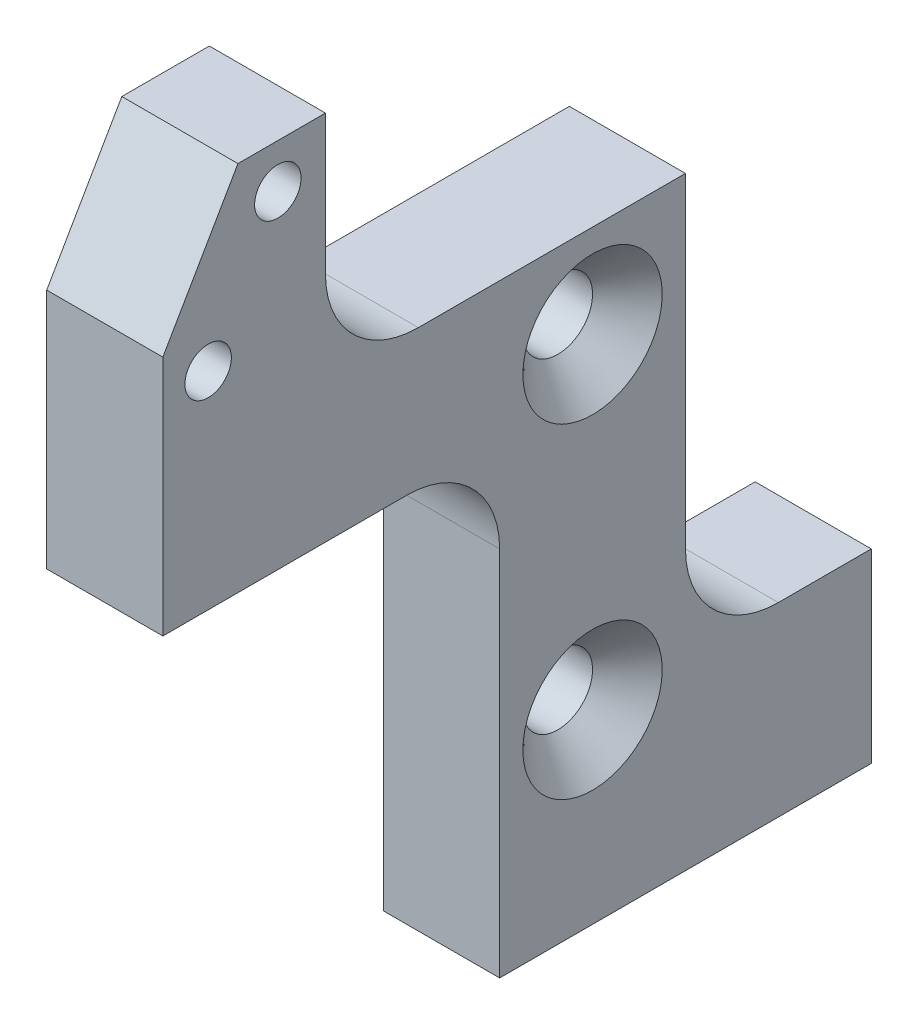
ISO-10303-21;
HEADER;
FILE_DESCRIPTION(('STEP AP214'),'2;1');
FILE_NAME('part.step','',(''),(''),'','','');
FILE_SCHEMA(('AUTOMOTIVE_DESIGN { 1 0 10303 214 1 1 1 1 }'));
ENDSEC;
DATA;
#1=APPLICATION_CONTEXT('core data for automotive mechanical design processes');
#2=APPLICATION_PROTOCOL_DEFINITION('international standard','automotive_design',2000,#1);
#3=PRODUCT_CONTEXT('',#1,'mechanical');
#4=PRODUCT('Part','Part','',(#3));
#5=PRODUCT_RELATED_PRODUCT_CATEGORY('part','',(#4));
#6=PRODUCT_DEFINITION_FORMATION('','',#4);
#7=PRODUCT_DEFINITION_CONTEXT('part definition',#1,'design');
#8=PRODUCT_DEFINITION('design','',#6,#7);
#9=PRODUCT_DEFINITION_SHAPE('','',#8);
#10=(LENGTH_UNIT() NAMED_UNIT(*) SI_UNIT(.MILLI.,.METRE.));
#11=(NAMED_UNIT(*) PLANE_ANGLE_UNIT() SI_UNIT($,.RADIAN.));
#12=(NAMED_UNIT(*) SI_UNIT($,.STERADIAN.) SOLID_ANGLE_UNIT());
#13=UNCERTAINTY_MEASURE_WITH_UNIT(LENGTH_MEASURE(1.E-05),#10,'distance_accuracy_value','');
#14=(GEOMETRIC_REPRESENTATION_CONTEXT(3) GLOBAL_UNCERTAINTY_ASSIGNED_CONTEXT((#13)) GLOBAL_UNIT_ASSIGNED_CONTEXT((#10,
#11,#12)) REPRESENTATION_CONTEXT('',''));
#15=CARTESIAN_POINT('',(0.,0.,0.));
#16=DIRECTION('',(0.,0.,1.));
#17=DIRECTION('',(1.,0.,0.));
#18=AXIS2_PLACEMENT_3D('',#15,#16,#17);
#19=CARTESIAN_POINT('',(5.,0.,0.));
#20=DIRECTION('',(-1.,0.,0.));
#21=DIRECTION('',(0.,0.,1.));
#22=AXIS2_PLACEMENT_3D('',#19,#20,#21);
#23=PLANE('',#22);
#24=CARTESIAN_POINT('',(5.,8.,-18.5));
#25=DIRECTION('',(-1.,0.,0.));
#26=DIRECTION('',(0.,0.,1.));
#27=AXIS2_PLACEMENT_3D('',#24,#25,#26);
#28=CIRCLE('',#27,3.);
#29=CARTESIAN_POINT('',(5.,8.,-15.5));
#30=VERTEX_POINT('',#29);
#31=EDGE_CURVE('E40',#30,#30,#28,.T.);
#32=ORIENTED_EDGE('',*,*,#31,.T.);
#33=EDGE_LOOP('',(#32));
#34=FACE_BOUND('',#33,.T.);
#35=CARTESIAN_POINT('',(5.,22.,-18.5));
#36=DIRECTION('',(-1.,0.,0.));
#37=DIRECTION('',(0.,0.,1.));
#38=AXIS2_PLACEMENT_3D('',#35,#36,#37);
#39=CIRCLE('',#38,3.);
#40=CARTESIAN_POINT('',(5.,22.,-15.5));
#41=VERTEX_POINT('',#40);
#42=EDGE_CURVE('E195',#41,#41,#39,.T.);
#43=ORIENTED_EDGE('',*,*,#42,.T.);
#44=EDGE_LOOP('',(#43));
#45=FACE_BOUND('',#44,.T.);
#46=CARTESIAN_POINT('',(5.,28.91,-1.95));
#47=DIRECTION('',(1.,0.,0.));
#48=DIRECTION('',(0.,0.,-1.));
#49=AXIS2_PLACEMENT_3D('',#46,#47,#48);
#50=CIRCLE('',#49,1.);
#51=CARTESIAN_POINT('',(5.,28.91,-2.95));
#52=VERTEX_POINT('',#51);
#53=EDGE_CURVE('E223',#52,#52,#50,.T.);
#54=ORIENTED_EDGE('',*,*,#53,.F.);
#55=EDGE_LOOP('',(#54));
#56=FACE_BOUND('',#55,.T.);
#57=DIRECTION('',(0.,1.,0.));
#58=VECTOR('',#57,1.);
#59=CARTESIAN_POINT('',(5.,8.,-30.5));
#60=LINE('',#59,#58);
#61=CARTESIAN_POINT('',(5.,0.,-30.5));
#62=VERTEX_POINT('',#61);
#63=CARTESIAN_POINT('',(5.,8.,-30.5));
#64=VERTEX_POINT('',#63);
#65=EDGE_CURVE('E147',#62,#64,#60,.T.);
#66=ORIENTED_EDGE('',*,*,#65,.T.);
#67=DIRECTION('',(0.,0.,1.));
#68=VECTOR('',#67,1.);
#69=CARTESIAN_POINT('',(5.,8.,-22.5));
#70=LINE('',#69,#68);
#71=CARTESIAN_POINT('',(5.,8.,-26.5));
#72=VERTEX_POINT('',#71);
#73=EDGE_CURVE('E135',#64,#72,#70,.T.);
#74=ORIENTED_EDGE('',*,*,#73,.T.);
#75=CARTESIAN_POINT('',(5.,12.,-26.5));
#76=DIRECTION('',(-1.,0.,0.));
#77=DIRECTION('',(0.,0.,1.));
#78=AXIS2_PLACEMENT_3D('',#75,#76,#77);
#79=CIRCLE('',#78,4.);
#80=CARTESIAN_POINT('',(5.,12.,-22.5));
#81=VERTEX_POINT('',#80);
#82=EDGE_CURVE('E183',#72,#81,#79,.T.);
#83=ORIENTED_EDGE('',*,*,#82,.T.);
#84=DIRECTION('',(0.,1.,0.));
#85=VECTOR('',#84,1.);
#86=CARTESIAN_POINT('',(5.,26.,-22.5));
#87=LINE('',#86,#85);
#88=CARTESIAN_POINT('',(5.,26.,-22.5));
#89=VERTEX_POINT('',#88);
#90=EDGE_CURVE('E146',#81,#89,#87,.T.);
#91=ORIENTED_EDGE('',*,*,#90,.T.);
#92=DIRECTION('',(0.,0.,1.));
#93=VECTOR('',#92,1.);
#94=CARTESIAN_POINT('',(5.,26.,-7.));
#95=LINE('',#94,#93);
#96=CARTESIAN_POINT('',(5.,26.,-11.));
#97=VERTEX_POINT('',#96);
#98=EDGE_CURVE('E228',#89,#97,#95,.T.);
#99=ORIENTED_EDGE('',*,*,#98,.T.);
#100=CARTESIAN_POINT('',(5.,30.,-11.));
#101=DIRECTION('',(-1.,0.,0.));
#102=DIRECTION('',(0.,0.,1.));
#103=AXIS2_PLACEMENT_3D('',#100,#101,#102);
#104=CIRCLE('',#103,4.);
#105=CARTESIAN_POINT('',(5.,30.,-7.));
#106=VERTEX_POINT('',#105);
#107=EDGE_CURVE('E190',#97,#106,#104,.T.);
#108=ORIENTED_EDGE('',*,*,#107,.T.);
#109=DIRECTION('',(0.,1.,0.));
#110=VECTOR('',#109,1.);
#111=CARTESIAN_POINT('',(5.,36.,-7.));
#112=LINE('',#111,#110);
#113=CARTESIAN_POINT('',(5.,36.,-7.));
#114=VERTEX_POINT('',#113);
#115=EDGE_CURVE('E230',#106,#114,#112,.T.);
#116=ORIENTED_EDGE('',*,*,#115,.T.);
#117=DIRECTION('',(0.,0.,1.));
#118=VECTOR('',#117,1.);
#119=CARTESIAN_POINT('',(5.,36.,-3.23316150746188));
#120=LINE('',#119,#118);
#121=CARTESIAN_POINT('',(5.,36.,-3.23316150746188));
#122=VERTEX_POINT('',#121);
#123=EDGE_CURVE('E232',#114,#122,#120,.T.);
#124=ORIENTED_EDGE('',*,*,#123,.T.);
#125=DIRECTION('',(0.,-0.86602540378444,0.499999999999998));
#126=VECTOR('',#125,1.);
#127=CARTESIAN_POINT('',(5.,30.4,0.));
#128=LINE('',#127,#126);
#129=CARTESIAN_POINT('',(5.,30.4,0.));
#130=VERTEX_POINT('',#129);
#131=EDGE_CURVE('E234',#122,#130,#128,.T.);
#132=ORIENTED_EDGE('',*,*,#131,.T.);
#133=DIRECTION('',(0.,-1.,0.));
#134=VECTOR('',#133,1.);
#135=CARTESIAN_POINT('',(5.,20.,0.));
#136=LINE('',#135,#134);
#137=CARTESIAN_POINT('',(5.,20.,0.));
#138=VERTEX_POINT('',#137);
#139=EDGE_CURVE('E236',#130,#138,#136,.T.);
#140=ORIENTED_EDGE('',*,*,#139,.T.);
#141=DIRECTION('',(0.,0.,-1.));
#142=VECTOR('',#141,1.);
#143=CARTESIAN_POINT('',(5.,20.,-14.5));
#144=LINE('',#143,#142);
#145=CARTESIAN_POINT('',(5.,20.,-10.5));
#146=VERTEX_POINT('',#145);
#147=EDGE_CURVE('E238',#138,#146,#144,.T.);
#148=ORIENTED_EDGE('',*,*,#147,.T.);
#149=CARTESIAN_POINT('',(5.,16.,-10.5));
#150=DIRECTION('',(-1.,0.,0.));
#151=DIRECTION('',(0.,0.,1.));
#152=AXIS2_PLACEMENT_3D('',#149,#150,#151);
#153=CIRCLE('',#152,4.);
#154=CARTESIAN_POINT('',(5.,16.,-14.5));
#155=VERTEX_POINT('',#154);
#156=EDGE_CURVE('E187',#146,#155,#153,.T.);
#157=ORIENTED_EDGE('',*,*,#156,.T.);
#158=DIRECTION('',(0.,-1.,0.));
#159=VECTOR('',#158,1.);
#160=CARTESIAN_POINT('',(5.,0.,-14.5));
#161=LINE('',#160,#159);
#162=CARTESIAN_POINT('',(5.,0.,-14.5));
#163=VERTEX_POINT('',#162);
#164=EDGE_CURVE('E241',#155,#163,#161,.T.);
#165=ORIENTED_EDGE('',*,*,#164,.T.);
#166=DIRECTION('',(0.,0.,-1.));
#167=VECTOR('',#166,1.);
#168=CARTESIAN_POINT('',(5.,0.,-30.5));
#169=LINE('',#168,#167);
#170=EDGE_CURVE('E152',#163,#62,#169,.T.);
#171=ORIENTED_EDGE('',*,*,#170,.T.);
#172=EDGE_LOOP('',(#66,#74,#83,#91,#99,#108,#116,#124,#132,#140,#148,#157,#165,#171));
#173=FACE_BOUND('',#172,.T.);
#174=CARTESIAN_POINT('',(5.,34.1061524227066,-4.94999999999999));
#175=DIRECTION('',(1.,0.,0.));
#176=DIRECTION('',(0.,0.,-1.));
#177=AXIS2_PLACEMENT_3D('',#174,#175,#176);
#178=CIRCLE('',#177,0.999999999999998);
#179=CARTESIAN_POINT('',(5.,34.1061524227066,-5.94999999999999));
#180=VERTEX_POINT('',#179);
#181=EDGE_CURVE('E397',#180,#180,#178,.T.);
#182=ORIENTED_EDGE('',*,*,#181,.F.);
#183=EDGE_LOOP('',(#182));
#184=FACE_BOUND('',#183,.T.);
#185=ADVANCED_FACE('F32',(#34,#45,#56,#173,#184),#23,.F.);
#186=CARTESIAN_POINT('',(0.,0.,0.));
#187=DIRECTION('',(-1.,0.,0.));
#188=DIRECTION('',(0.,0.,1.));
#189=AXIS2_PLACEMENT_3D('',#186,#187,#188);
#190=PLANE('',#189);
#191=CARTESIAN_POINT('',(0.,28.91,-1.95));
#192=DIRECTION('',(1.,0.,0.));
#193=DIRECTION('',(0.,0.,-1.));
#194=AXIS2_PLACEMENT_3D('',#191,#192,#193);
#195=CIRCLE('',#194,1.);
#196=CARTESIAN_POINT('',(0.,28.91,-2.95));
#197=VERTEX_POINT('',#196);
#198=EDGE_CURVE('E400',#197,#197,#195,.T.);
#199=ORIENTED_EDGE('',*,*,#198,.T.);
#200=EDGE_LOOP('',(#199));
#201=FACE_BOUND('',#200,.T.);
#202=CARTESIAN_POINT('',(0.,8.,-18.5));
#203=DIRECTION('',(1.,0.,0.));
#204=DIRECTION('',(0.,0.,-1.));
#205=AXIS2_PLACEMENT_3D('',#202,#203,#204);
#206=CIRCLE('',#205,1.5);
#207=CARTESIAN_POINT('',(0.,8.,-20.));
#208=VERTEX_POINT('',#207);
#209=EDGE_CURVE('E216',#208,#208,#206,.T.);
#210=ORIENTED_EDGE('',*,*,#209,.T.);
#211=EDGE_LOOP('',(#210));
#212=FACE_BOUND('',#211,.T.);
#213=DIRECTION('',(0.,1.,0.));
#214=VECTOR('',#213,1.);
#215=CARTESIAN_POINT('',(0.,8.,-30.5));
#216=LINE('',#215,#214);
#217=CARTESIAN_POINT('',(0.,0.,-30.5));
#218=VERTEX_POINT('',#217);
#219=CARTESIAN_POINT('',(0.,8.,-30.5));
#220=VERTEX_POINT('',#219);
#221=EDGE_CURVE('E160',#218,#220,#216,.T.);
#222=ORIENTED_EDGE('',*,*,#221,.F.);
#223=DIRECTION('',(0.,0.,-1.));
#224=VECTOR('',#223,1.);
#225=CARTESIAN_POINT('',(0.,0.,-30.5));
#226=LINE('',#225,#224);
#227=CARTESIAN_POINT('',(0.,0.,-14.5));
#228=VERTEX_POINT('',#227);
#229=EDGE_CURVE('E156',#228,#218,#226,.T.);
#230=ORIENTED_EDGE('',*,*,#229,.F.);
#231=DIRECTION('',(0.,-1.,0.));
#232=VECTOR('',#231,1.);
#233=CARTESIAN_POINT('',(0.,0.,-14.5));
#234=LINE('',#233,#232);
#235=CARTESIAN_POINT('',(0.,16.,-14.5));
#236=VERTEX_POINT('',#235);
#237=EDGE_CURVE('E261',#236,#228,#234,.T.);
#238=ORIENTED_EDGE('',*,*,#237,.F.);
#239=CARTESIAN_POINT('',(0.,16.,-10.5));
#240=DIRECTION('',(-1.,0.,0.));
#241=DIRECTION('',(0.,0.,1.));
#242=AXIS2_PLACEMENT_3D('',#239,#240,#241);
#243=CIRCLE('',#242,4.);
#244=CARTESIAN_POINT('',(0.,20.,-10.5));
#245=VERTEX_POINT('',#244);
#246=EDGE_CURVE('E185',#236,#245,#243,.F.);
#247=ORIENTED_EDGE('',*,*,#246,.T.);
#248=DIRECTION('',(0.,0.,-1.));
#249=VECTOR('',#248,1.);
#250=CARTESIAN_POINT('',(0.,20.,-14.5));
#251=LINE('',#250,#249);
#252=CARTESIAN_POINT('',(0.,20.,0.));
#253=VERTEX_POINT('',#252);
#254=EDGE_CURVE('E258',#253,#245,#251,.T.);
#255=ORIENTED_EDGE('',*,*,#254,.F.);
#256=DIRECTION('',(0.,-1.,0.));
#257=VECTOR('',#256,1.);
#258=CARTESIAN_POINT('',(0.,20.,0.));
#259=LINE('',#258,#257);
#260=CARTESIAN_POINT('',(0.,30.4,0.));
#261=VERTEX_POINT('',#260);
#262=EDGE_CURVE('E256',#261,#253,#259,.T.);
#263=ORIENTED_EDGE('',*,*,#262,.F.);
#264=DIRECTION('',(0.,-0.86602540378444,0.499999999999998));
#265=VECTOR('',#264,1.);
#266=CARTESIAN_POINT('',(0.,30.4,0.));
#267=LINE('',#266,#265);
#268=CARTESIAN_POINT('',(0.,36.,-3.23316150746188));
#269=VERTEX_POINT('',#268);
#270=EDGE_CURVE('E254',#269,#261,#267,.T.);
#271=ORIENTED_EDGE('',*,*,#270,.F.);
#272=DIRECTION('',(0.,0.,1.));
#273=VECTOR('',#272,1.);
#274=CARTESIAN_POINT('',(0.,36.,-3.23316150746188));
#275=LINE('',#274,#273);
#276=CARTESIAN_POINT('',(0.,36.,-7.));
#277=VERTEX_POINT('',#276);
#278=EDGE_CURVE('E252',#277,#269,#275,.T.);
#279=ORIENTED_EDGE('',*,*,#278,.F.);
#280=DIRECTION('',(0.,1.,0.));
#281=VECTOR('',#280,1.);
#282=CARTESIAN_POINT('',(0.,36.,-7.));
#283=LINE('',#282,#281);
#284=CARTESIAN_POINT('',(0.,30.,-7.));
#285=VERTEX_POINT('',#284);
#286=EDGE_CURVE('E250',#285,#277,#283,.T.);
#287=ORIENTED_EDGE('',*,*,#286,.F.);
#288=CARTESIAN_POINT('',(0.,30.,-11.));
#289=DIRECTION('',(-1.,0.,0.));
#290=DIRECTION('',(0.,0.,1.));
#291=AXIS2_PLACEMENT_3D('',#288,#289,#290);
#292=CIRCLE('',#291,4.);
#293=CARTESIAN_POINT('',(0.,26.,-11.));
#294=VERTEX_POINT('',#293);
#295=EDGE_CURVE('E55',#285,#294,#292,.F.);
#296=ORIENTED_EDGE('',*,*,#295,.T.);
#297=DIRECTION('',(0.,0.,1.));
#298=VECTOR('',#297,1.);
#299=CARTESIAN_POINT('',(0.,26.,-7.));
#300=LINE('',#299,#298);
#301=CARTESIAN_POINT('',(0.,26.,-22.5));
#302=VERTEX_POINT('',#301);
#303=EDGE_CURVE('E248',#302,#294,#300,.T.);
#304=ORIENTED_EDGE('',*,*,#303,.F.);
#305=DIRECTION('',(0.,1.,0.));
#306=VECTOR('',#305,1.);
#307=CARTESIAN_POINT('',(0.,26.,-22.5));
#308=LINE('',#307,#306);
#309=CARTESIAN_POINT('',(0.,12.,-22.5));
#310=VERTEX_POINT('',#309);
#311=EDGE_CURVE('E246',#310,#302,#308,.T.);
#312=ORIENTED_EDGE('',*,*,#311,.F.);
#313=CARTESIAN_POINT('',(0.,12.,-26.5));
#314=DIRECTION('',(-1.,0.,0.));
#315=DIRECTION('',(0.,0.,1.));
#316=AXIS2_PLACEMENT_3D('',#313,#314,#315);
#317=CIRCLE('',#316,4.);
#318=CARTESIAN_POINT('',(0.,8.,-26.5));
#319=VERTEX_POINT('',#318);
#320=EDGE_CURVE('E181',#310,#319,#317,.F.);
#321=ORIENTED_EDGE('',*,*,#320,.T.);
#322=DIRECTION('',(0.,0.,1.));
#323=VECTOR('',#322,1.);
#324=CARTESIAN_POINT('',(0.,8.,-22.5));
#325=LINE('',#324,#323);
#326=EDGE_CURVE('E220',#220,#319,#325,.T.);
#327=ORIENTED_EDGE('',*,*,#326,.F.);
#328=EDGE_LOOP('',(#222,#230,#238,#247,#255,#263,#271,#279,#287,#296,#304,#312,#321,#327));
#329=FACE_BOUND('',#328,.T.);
#330=CARTESIAN_POINT('',(0.,22.,-18.5));
#331=DIRECTION('',(1.,0.,0.));
#332=DIRECTION('',(0.,0.,-1.));
#333=AXIS2_PLACEMENT_3D('',#330,#331,#332);
#334=CIRCLE('',#333,1.5);
#335=CARTESIAN_POINT('',(0.,22.,-20.));
#336=VERTEX_POINT('',#335);
#337=EDGE_CURVE('E218',#336,#336,#334,.T.);
#338=ORIENTED_EDGE('',*,*,#337,.T.);
#339=EDGE_LOOP('',(#338));
#340=FACE_BOUND('',#339,.T.);
#341=CARTESIAN_POINT('',(0.,34.1061524227066,-4.94999999999999));
#342=DIRECTION('',(1.,0.,0.));
#343=DIRECTION('',(0.,0.,-1.));
#344=AXIS2_PLACEMENT_3D('',#341,#342,#343);
#345=CIRCLE('',#344,0.999999999999998);
#346=CARTESIAN_POINT('',(0.,34.1061524227066,-5.94999999999999));
#347=VERTEX_POINT('',#346);
#348=EDGE_CURVE('E396',#347,#347,#345,.T.);
#349=ORIENTED_EDGE('',*,*,#348,.T.);
#350=EDGE_LOOP('',(#349));
#351=FACE_BOUND('',#350,.T.);
#352=ADVANCED_FACE('F286',(#201,#212,#329,#340,#351),#190,.T.);
#353=CARTESIAN_POINT('',(5.,8.,-30.5));
#354=DIRECTION('',(0.,0.,1.));
#355=DIRECTION('',(1.,0.,0.));
#356=AXIS2_PLACEMENT_3D('',#353,#354,#355);
#357=PLANE('',#356);
#358=ORIENTED_EDGE('',*,*,#221,.T.);
#359=DIRECTION('',(-1.,0.,0.));
#360=VECTOR('',#359,1.);
#361=CARTESIAN_POINT('',(5.,8.,-30.5));
#362=LINE('',#361,#360);
#363=EDGE_CURVE('E140',#64,#220,#362,.T.);
#364=ORIENTED_EDGE('',*,*,#363,.F.);
#365=ORIENTED_EDGE('',*,*,#65,.F.);
#366=DIRECTION('',(-1.,0.,0.));
#367=VECTOR('',#366,1.);
#368=CARTESIAN_POINT('',(5.,0.,-30.5));
#369=LINE('',#368,#367);
#370=EDGE_CURVE('E243',#62,#218,#369,.T.);
#371=ORIENTED_EDGE('',*,*,#370,.T.);
#372=EDGE_LOOP('',(#358,#364,#365,#371));
#373=FACE_BOUND('',#372,.T.);
#374=ADVANCED_FACE('F158',(#373),#357,.F.);
#375=CARTESIAN_POINT('',(5.,8.,-22.5));
#376=DIRECTION('',(0.,-1.,0.));
#377=DIRECTION('',(0.,0.,-1.));
#378=AXIS2_PLACEMENT_3D('',#375,#376,#377);
#379=PLANE('',#378);
#380=ORIENTED_EDGE('',*,*,#326,.T.);
#381=DIRECTION('',(-1.,0.,0.));
#382=VECTOR('',#381,1.);
#383=CARTESIAN_POINT('',(5.,8.,-26.5));
#384=LINE('',#383,#382);
#385=EDGE_CURVE('E143',#319,#72,#384,.F.);
#386=ORIENTED_EDGE('',*,*,#385,.T.);
#387=ORIENTED_EDGE('',*,*,#73,.F.);
#388=ORIENTED_EDGE('',*,*,#363,.T.);
#389=EDGE_LOOP('',(#380,#386,#387,#388));
#390=FACE_BOUND('',#389,.T.);
#391=ADVANCED_FACE('F138',(#390),#379,.F.);
#392=CARTESIAN_POINT('',(5.,26.,-22.5));
#393=DIRECTION('',(0.,0.,1.));
#394=DIRECTION('',(0.,-1.,0.));
#395=AXIS2_PLACEMENT_3D('',#392,#393,#394);
#396=PLANE('',#395);
#397=ORIENTED_EDGE('',*,*,#90,.F.);
#398=DIRECTION('',(-1.,0.,0.));
#399=VECTOR('',#398,1.);
#400=CARTESIAN_POINT('',(0.,12.,-22.5));
#401=LINE('',#400,#399);
#402=EDGE_CURVE('E161',#81,#310,#401,.T.);
#403=ORIENTED_EDGE('',*,*,#402,.T.);
#404=ORIENTED_EDGE('',*,*,#311,.T.);
#405=DIRECTION('',(-1.,0.,0.));
#406=VECTOR('',#405,1.);
#407=CARTESIAN_POINT('',(5.,26.,-22.5));
#408=LINE('',#407,#406);
#409=EDGE_CURVE('E162',#89,#302,#408,.T.);
#410=ORIENTED_EDGE('',*,*,#409,.F.);
#411=EDGE_LOOP('',(#397,#403,#404,#410));
#412=FACE_BOUND('',#411,.T.);
#413=ADVANCED_FACE('F350',(#412),#396,.F.);
#414=CARTESIAN_POINT('',(5.,26.,-7.));
#415=DIRECTION('',(0.,-1.,0.));
#416=DIRECTION('',(0.,0.,-1.));
#417=AXIS2_PLACEMENT_3D('',#414,#415,#416);
#418=PLANE('',#417);
#419=ORIENTED_EDGE('',*,*,#303,.T.);
#420=DIRECTION('',(-1.,0.,0.));
#421=VECTOR('',#420,1.);
#422=CARTESIAN_POINT('',(5.,26.,-11.));
#423=LINE('',#422,#421);
#424=EDGE_CURVE('E47',#294,#97,#423,.F.);
#425=ORIENTED_EDGE('',*,*,#424,.T.);
#426=ORIENTED_EDGE('',*,*,#98,.F.);
#427=ORIENTED_EDGE('',*,*,#409,.T.);
#428=EDGE_LOOP('',(#419,#425,#426,#427));
#429=FACE_BOUND('',#428,.T.);
#430=ADVANCED_FACE('F347',(#429),#418,.F.);
#431=CARTESIAN_POINT('',(5.,36.,-7.));
#432=DIRECTION('',(0.,0.,1.));
#433=DIRECTION('',(0.,-1.,0.));
#434=AXIS2_PLACEMENT_3D('',#431,#432,#433);
#435=PLANE('',#434);
#436=ORIENTED_EDGE('',*,*,#115,.F.);
#437=DIRECTION('',(-1.,0.,0.));
#438=VECTOR('',#437,1.);
#439=CARTESIAN_POINT('',(0.,30.,-7.));
#440=LINE('',#439,#438);
#441=EDGE_CURVE('E177',#106,#285,#440,.T.);
#442=ORIENTED_EDGE('',*,*,#441,.T.);
#443=ORIENTED_EDGE('',*,*,#286,.T.);
#444=DIRECTION('',(-1.,0.,0.));
#445=VECTOR('',#444,1.);
#446=CARTESIAN_POINT('',(5.,36.,-7.));
#447=LINE('',#446,#445);
#448=EDGE_CURVE('E167',#114,#277,#447,.T.);
#449=ORIENTED_EDGE('',*,*,#448,.F.);
#450=EDGE_LOOP('',(#436,#442,#443,#449));
#451=FACE_BOUND('',#450,.T.);
#452=ADVANCED_FACE('F302',(#451),#435,.F.);
#453=CARTESIAN_POINT('',(5.,36.,-3.23316150746188));
#454=DIRECTION('',(0.,-1.,0.));
#455=DIRECTION('',(0.,0.,-1.));
#456=AXIS2_PLACEMENT_3D('',#453,#454,#455);
#457=PLANE('',#456);
#458=ORIENTED_EDGE('',*,*,#278,.T.);
#459=DIRECTION('',(-1.,0.,0.));
#460=VECTOR('',#459,1.);
#461=CARTESIAN_POINT('',(5.,36.,-3.23316150746188));
#462=LINE('',#461,#460);
#463=EDGE_CURVE('E274',#122,#269,#462,.T.);
#464=ORIENTED_EDGE('',*,*,#463,.F.);
#465=ORIENTED_EDGE('',*,*,#123,.F.);
#466=ORIENTED_EDGE('',*,*,#448,.T.);
#467=EDGE_LOOP('',(#458,#464,#465,#466));
#468=FACE_BOUND('',#467,.T.);
#469=ADVANCED_FACE('F281',(#468),#457,.F.);
#470=CARTESIAN_POINT('',(5.,30.4,0.));
#471=DIRECTION('',(0.,-0.499999999999998,-0.86602540378444));
#472=DIRECTION('',(0.,0.86602540378444,-0.499999999999998));
#473=AXIS2_PLACEMENT_3D('',#470,#471,#472);
#474=PLANE('',#473);
#475=ORIENTED_EDGE('',*,*,#270,.T.);
#476=DIRECTION('',(-1.,0.,0.));
#477=VECTOR('',#476,1.);
#478=CARTESIAN_POINT('',(5.,30.4,0.));
#479=LINE('',#478,#477);
#480=EDGE_CURVE('E271',#130,#261,#479,.T.);
#481=ORIENTED_EDGE('',*,*,#480,.F.);
#482=ORIENTED_EDGE('',*,*,#131,.F.);
#483=ORIENTED_EDGE('',*,*,#463,.T.);
#484=EDGE_LOOP('',(#475,#481,#482,#483));
#485=FACE_BOUND('',#484,.T.);
#486=ADVANCED_FACE('F292',(#485),#474,.F.);
#487=CARTESIAN_POINT('',(5.,20.,0.));
#488=DIRECTION('',(0.,0.,-1.));
#489=DIRECTION('',(0.,1.,0.));
#490=AXIS2_PLACEMENT_3D('',#487,#488,#489);
#491=PLANE('',#490);
#492=ORIENTED_EDGE('',*,*,#262,.T.);
#493=DIRECTION('',(-1.,0.,0.));
#494=VECTOR('',#493,1.);
#495=CARTESIAN_POINT('',(5.,20.,0.));
#496=LINE('',#495,#494);
#497=EDGE_CURVE('E268',#138,#253,#496,.T.);
#498=ORIENTED_EDGE('',*,*,#497,.F.);
#499=ORIENTED_EDGE('',*,*,#139,.F.);
#500=ORIENTED_EDGE('',*,*,#480,.T.);
#501=EDGE_LOOP('',(#492,#498,#499,#500));
#502=FACE_BOUND('',#501,.T.);
#503=ADVANCED_FACE('F296',(#502),#491,.F.);
#504=CARTESIAN_POINT('',(5.,20.,-14.5));
#505=DIRECTION('',(0.,1.,0.));
#506=DIRECTION('',(0.,0.,1.));
#507=AXIS2_PLACEMENT_3D('',#504,#505,#506);
#508=PLANE('',#507);
#509=ORIENTED_EDGE('',*,*,#254,.T.);
#510=DIRECTION('',(-1.,0.,0.));
#511=VECTOR('',#510,1.);
#512=CARTESIAN_POINT('',(5.,20.,-10.5));
#513=LINE('',#512,#511);
#514=EDGE_CURVE('E175',#245,#146,#513,.F.);
#515=ORIENTED_EDGE('',*,*,#514,.T.);
#516=ORIENTED_EDGE('',*,*,#147,.F.);
#517=ORIENTED_EDGE('',*,*,#497,.T.);
#518=EDGE_LOOP('',(#509,#515,#516,#517));
#519=FACE_BOUND('',#518,.T.);
#520=ADVANCED_FACE('F334',(#519),#508,.F.);
#521=CARTESIAN_POINT('',(5.,0.,-14.5));
#522=DIRECTION('',(0.,0.,-1.));
#523=DIRECTION('',(-1.,0.,0.));
#524=AXIS2_PLACEMENT_3D('',#521,#522,#523);
#525=PLANE('',#524);
#526=ORIENTED_EDGE('',*,*,#164,.F.);
#527=DIRECTION('',(-1.,0.,0.));
#528=VECTOR('',#527,1.);
#529=CARTESIAN_POINT('',(0.,16.,-14.5));
#530=LINE('',#529,#528);
#531=EDGE_CURVE('E172',#155,#236,#530,.T.);
#532=ORIENTED_EDGE('',*,*,#531,.T.);
#533=ORIENTED_EDGE('',*,*,#237,.T.);
#534=DIRECTION('',(-1.,0.,0.));
#535=VECTOR('',#534,1.);
#536=CARTESIAN_POINT('',(5.,0.,-14.5));
#537=LINE('',#536,#535);
#538=EDGE_CURVE('E265',#163,#228,#537,.T.);
#539=ORIENTED_EDGE('',*,*,#538,.F.);
#540=EDGE_LOOP('',(#526,#532,#533,#539));
#541=FACE_BOUND('',#540,.T.);
#542=ADVANCED_FACE('F330',(#541),#525,.F.);
#543=CARTESIAN_POINT('',(5.,0.,-30.5));
#544=DIRECTION('',(0.,1.,0.));
#545=DIRECTION('',(0.,0.,1.));
#546=AXIS2_PLACEMENT_3D('',#543,#544,#545);
#547=PLANE('',#546);
#548=CARTESIAN_POINT('',(2.5,0.,-17.5));
#549=DIRECTION('',(0.,-1.,0.));
#550=DIRECTION('',(0.,0.,-1.));
#551=AXIS2_PLACEMENT_3D('',#548,#549,#550);
#552=CIRCLE('',#551,1.25);
#553=CARTESIAN_POINT('',(2.5,0.,-18.75));
#554=VERTEX_POINT('',#553);
#555=EDGE_CURVE('E418',#554,#554,#552,.T.);
#556=ORIENTED_EDGE('',*,*,#555,.F.);
#557=EDGE_LOOP('',(#556));
#558=FACE_BOUND('',#557,.T.);
#559=CARTESIAN_POINT('',(2.5,0.,-27.5));
#560=DIRECTION('',(0.,-1.,0.));
#561=DIRECTION('',(0.,0.,-1.));
#562=AXIS2_PLACEMENT_3D('',#559,#560,#561);
#563=CIRCLE('',#562,1.25);
#564=CARTESIAN_POINT('',(2.5,0.,-28.75));
#565=VERTEX_POINT('',#564);
#566=EDGE_CURVE('E403',#565,#565,#563,.T.);
#567=ORIENTED_EDGE('',*,*,#566,.F.);
#568=EDGE_LOOP('',(#567));
#569=FACE_BOUND('',#568,.T.);
#570=ORIENTED_EDGE('',*,*,#229,.T.);
#571=ORIENTED_EDGE('',*,*,#370,.F.);
#572=ORIENTED_EDGE('',*,*,#170,.F.);
#573=ORIENTED_EDGE('',*,*,#538,.T.);
#574=EDGE_LOOP('',(#570,#571,#572,#573));
#575=FACE_BOUND('',#574,.T.);
#576=ADVANCED_FACE('F212',(#558,#569,#575),#547,.F.);
#577=CARTESIAN_POINT('',(5.,8.,-18.5));
#578=DIRECTION('',(-1.,0.,0.));
#579=DIRECTION('',(0.,0.,1.));
#580=AXIS2_PLACEMENT_3D('',#577,#578,#579);
#581=CYLINDRICAL_SURFACE('',#580,1.5);
#582=CARTESIAN_POINT('',(3.50000000000001,8.,-18.5));
#583=DIRECTION('',(-1.,0.,0.));
#584=DIRECTION('',(0.,0.,1.));
#585=AXIS2_PLACEMENT_3D('',#582,#583,#584);
#586=CIRCLE('',#585,1.5);
#587=CARTESIAN_POINT('',(3.50000000000001,8.,-17.));
#588=VERTEX_POINT('',#587);
#589=EDGE_CURVE('E192',#588,#588,#586,.F.);
#590=ORIENTED_EDGE('',*,*,#589,.T.);
#591=EDGE_LOOP('',(#590));
#592=FACE_BOUND('',#591,.T.);
#593=ORIENTED_EDGE('',*,*,#209,.F.);
#594=EDGE_LOOP('',(#593));
#595=FACE_BOUND('',#594,.T.);
#596=ADVANCED_FACE('F208',(#592,#595),#581,.F.);
#597=CARTESIAN_POINT('',(5.,22.,-18.5));
#598=DIRECTION('',(-1.,0.,0.));
#599=DIRECTION('',(0.,0.,1.));
#600=AXIS2_PLACEMENT_3D('',#597,#598,#599);
#601=CYLINDRICAL_SURFACE('',#600,1.5);
#602=CARTESIAN_POINT('',(3.50000000000001,22.,-18.5));
#603=DIRECTION('',(-1.,0.,0.));
#604=DIRECTION('',(0.,0.,1.));
#605=AXIS2_PLACEMENT_3D('',#602,#603,#604);
#606=CIRCLE('',#605,1.5);
#607=CARTESIAN_POINT('',(3.50000000000001,22.,-17.));
#608=VERTEX_POINT('',#607);
#609=EDGE_CURVE('E11',#608,#608,#606,.F.);
#610=ORIENTED_EDGE('',*,*,#609,.T.);
#611=EDGE_LOOP('',(#610));
#612=FACE_BOUND('',#611,.T.);
#613=ORIENTED_EDGE('',*,*,#337,.F.);
#614=EDGE_LOOP('',(#613));
#615=FACE_BOUND('',#614,.T.);
#616=ADVANCED_FACE('F211',(#612,#615),#601,.F.);
#617=CARTESIAN_POINT('',(5.,28.91,-1.95));
#618=DIRECTION('',(-1.,0.,0.));
#619=DIRECTION('',(0.,0.,1.));
#620=AXIS2_PLACEMENT_3D('',#617,#618,#619);
#621=CYLINDRICAL_SURFACE('',#620,1.);
#622=ORIENTED_EDGE('',*,*,#53,.T.);
#623=EDGE_LOOP('',(#622));
#624=FACE_BOUND('',#623,.T.);
#625=ORIENTED_EDGE('',*,*,#198,.F.);
#626=EDGE_LOOP('',(#625));
#627=FACE_BOUND('',#626,.T.);
#628=ADVANCED_FACE('F364',(#624,#627),#621,.F.);
#629=CARTESIAN_POINT('',(5.,34.1061524227066,-4.94999999999999));
#630=DIRECTION('',(-1.,0.,0.));
#631=DIRECTION('',(0.,0.,1.));
#632=AXIS2_PLACEMENT_3D('',#629,#630,#631);
#633=CYLINDRICAL_SURFACE('',#632,0.999999999999998);
#634=ORIENTED_EDGE('',*,*,#181,.T.);
#635=EDGE_LOOP('',(#634));
#636=FACE_BOUND('',#635,.T.);
#637=ORIENTED_EDGE('',*,*,#348,.F.);
#638=EDGE_LOOP('',(#637));
#639=FACE_BOUND('',#638,.T.);
#640=ADVANCED_FACE('F359',(#636,#639),#633,.F.);
#641=CARTESIAN_POINT('',(5.,12.,-26.5));
#642=DIRECTION('',(1.,0.,0.));
#643=DIRECTION('',(0.,0.,-1.));
#644=AXIS2_PLACEMENT_3D('',#641,#642,#643);
#645=CYLINDRICAL_SURFACE('',#644,4.);
#646=ORIENTED_EDGE('',*,*,#82,.F.);
#647=ORIENTED_EDGE('',*,*,#385,.F.);
#648=ORIENTED_EDGE('',*,*,#320,.F.);
#649=ORIENTED_EDGE('',*,*,#402,.F.);
#650=EDGE_LOOP('',(#646,#647,#648,#649));
#651=FACE_BOUND('',#650,.T.);
#652=ADVANCED_FACE('F316',(#651),#645,.F.);
#653=CARTESIAN_POINT('',(5.,16.,-10.5));
#654=DIRECTION('',(1.,0.,0.));
#655=DIRECTION('',(0.,0.,-1.));
#656=AXIS2_PLACEMENT_3D('',#653,#654,#655);
#657=CYLINDRICAL_SURFACE('',#656,4.);
#658=ORIENTED_EDGE('',*,*,#156,.F.);
#659=ORIENTED_EDGE('',*,*,#514,.F.);
#660=ORIENTED_EDGE('',*,*,#246,.F.);
#661=ORIENTED_EDGE('',*,*,#531,.F.);
#662=EDGE_LOOP('',(#658,#659,#660,#661));
#663=FACE_BOUND('',#662,.T.);
#664=ADVANCED_FACE('F307',(#663),#657,.F.);
#665=CARTESIAN_POINT('',(5.,30.,-11.));
#666=DIRECTION('',(1.,0.,0.));
#667=DIRECTION('',(0.,0.,-1.));
#668=AXIS2_PLACEMENT_3D('',#665,#666,#667);
#669=CYLINDRICAL_SURFACE('',#668,4.);
#670=ORIENTED_EDGE('',*,*,#107,.F.);
#671=ORIENTED_EDGE('',*,*,#424,.F.);
#672=ORIENTED_EDGE('',*,*,#295,.F.);
#673=ORIENTED_EDGE('',*,*,#441,.F.);
#674=EDGE_LOOP('',(#670,#671,#672,#673));
#675=FACE_BOUND('',#674,.T.);
#676=ADVANCED_FACE('F304',(#675),#669,.F.);
#677=CARTESIAN_POINT('',(2.5,4.,-27.5));
#678=DIRECTION('',(0.,1.,0.));
#679=DIRECTION('',(0.,0.,1.));
#680=AXIS2_PLACEMENT_3D('',#677,#678,#679);
#681=PLANE('',#680);
#682=CARTESIAN_POINT('',(2.5,4.,-27.5));
#683=DIRECTION('',(0.,-1.,0.));
#684=DIRECTION('',(0.,0.,-1.));
#685=AXIS2_PLACEMENT_3D('',#682,#683,#684);
#686=CIRCLE('',#685,1.25);
#687=CARTESIAN_POINT('',(2.5,4.,-28.75));
#688=VERTEX_POINT('',#687);
#689=EDGE_CURVE('E398',#688,#688,#686,.T.);
#690=ORIENTED_EDGE('',*,*,#689,.T.);
#691=EDGE_LOOP('',(#690));
#692=FACE_BOUND('',#691,.T.);
#693=ADVANCED_FACE('F306',(#692),#681,.F.);
#694=CARTESIAN_POINT('',(2.5,0.,-27.5));
#695=DIRECTION('',(0.,-1.,0.));
#696=DIRECTION('',(0.,0.,-1.));
#697=AXIS2_PLACEMENT_3D('',#694,#695,#696);
#698=CYLINDRICAL_SURFACE('',#697,1.25);
#699=ORIENTED_EDGE('',*,*,#689,.F.);
#700=EDGE_LOOP('',(#699));
#701=FACE_BOUND('',#700,.T.);
#702=ORIENTED_EDGE('',*,*,#566,.T.);
#703=EDGE_LOOP('',(#702));
#704=FACE_BOUND('',#703,.T.);
#705=ADVANCED_FACE('F313',(#701,#704),#698,.F.);
#706=CARTESIAN_POINT('',(2.5,4.,-17.5));
#707=DIRECTION('',(0.,1.,0.));
#708=DIRECTION('',(0.,0.,1.));
#709=AXIS2_PLACEMENT_3D('',#706,#707,#708);
#710=PLANE('',#709);
#711=CARTESIAN_POINT('',(2.5,4.,-17.5));
#712=DIRECTION('',(0.,-1.,0.));
#713=DIRECTION('',(0.,0.,-1.));
#714=AXIS2_PLACEMENT_3D('',#711,#712,#713);
#715=CIRCLE('',#714,1.25);
#716=CARTESIAN_POINT('',(2.5,4.,-18.75));
#717=VERTEX_POINT('',#716);
#718=EDGE_CURVE('E415',#717,#717,#715,.T.);
#719=ORIENTED_EDGE('',*,*,#718,.T.);
#720=EDGE_LOOP('',(#719));
#721=FACE_BOUND('',#720,.T.);
#722=ADVANCED_FACE('F426',(#721),#710,.F.);
#723=CARTESIAN_POINT('',(2.5,0.,-17.5));
#724=DIRECTION('',(0.,-1.,0.));
#725=DIRECTION('',(0.,0.,-1.));
#726=AXIS2_PLACEMENT_3D('',#723,#724,#725);
#727=CYLINDRICAL_SURFACE('',#726,1.25);
#728=ORIENTED_EDGE('',*,*,#718,.F.);
#729=EDGE_LOOP('',(#728));
#730=FACE_BOUND('',#729,.T.);
#731=ORIENTED_EDGE('',*,*,#555,.T.);
#732=EDGE_LOOP('',(#731));
#733=FACE_BOUND('',#732,.T.);
#734=ADVANCED_FACE('F205',(#730,#733),#727,.F.);
#735=CARTESIAN_POINT('',(3.50000000000001,8.,-18.5));
#736=DIRECTION('',(1.,0.,0.));
#737=DIRECTION('',(0.,0.,-1.));
#738=AXIS2_PLACEMENT_3D('',#735,#736,#737);
#739=CONICAL_SURFACE('',#738,1.5,0.785398163397451);
#740=ORIENTED_EDGE('',*,*,#31,.F.);
#741=EDGE_LOOP('',(#740));
#742=FACE_BOUND('',#741,.T.);
#743=ORIENTED_EDGE('',*,*,#589,.F.);
#744=EDGE_LOOP('',(#743));
#745=FACE_BOUND('',#744,.T.);
#746=ADVANCED_FACE('F202',(#742,#745),#739,.F.);
#747=CARTESIAN_POINT('',(3.50000000000001,22.,-18.5));
#748=DIRECTION('',(1.,0.,0.));
#749=DIRECTION('',(0.,0.,-1.));
#750=AXIS2_PLACEMENT_3D('',#747,#748,#749);
#751=CONICAL_SURFACE('',#750,1.5,0.785398163397451);
#752=ORIENTED_EDGE('',*,*,#42,.F.);
#753=EDGE_LOOP('',(#752));
#754=FACE_BOUND('',#753,.T.);
#755=ORIENTED_EDGE('',*,*,#609,.F.);
#756=EDGE_LOOP('',(#755));
#757=FACE_BOUND('',#756,.T.);
#758=ADVANCED_FACE('F34',(#754,#757),#751,.F.);
#759=CLOSED_SHELL('',(#185,#352,#374,#391,#413,#430,#452,#469,#486,#503,#520,#542,#576,#596,
#616,#628,#640,#652,#664,#676,#693,#705,#722,#734,#746,#758));
#760=MANIFOLD_SOLID_BREP('B2',#759);
#761=ADVANCED_BREP_SHAPE_REPRESENTATION('',(#18,#760),#14);
#762=SHAPE_DEFINITION_REPRESENTATION(#9,#761);
ENDSEC;
END-ISO-10303-21;
